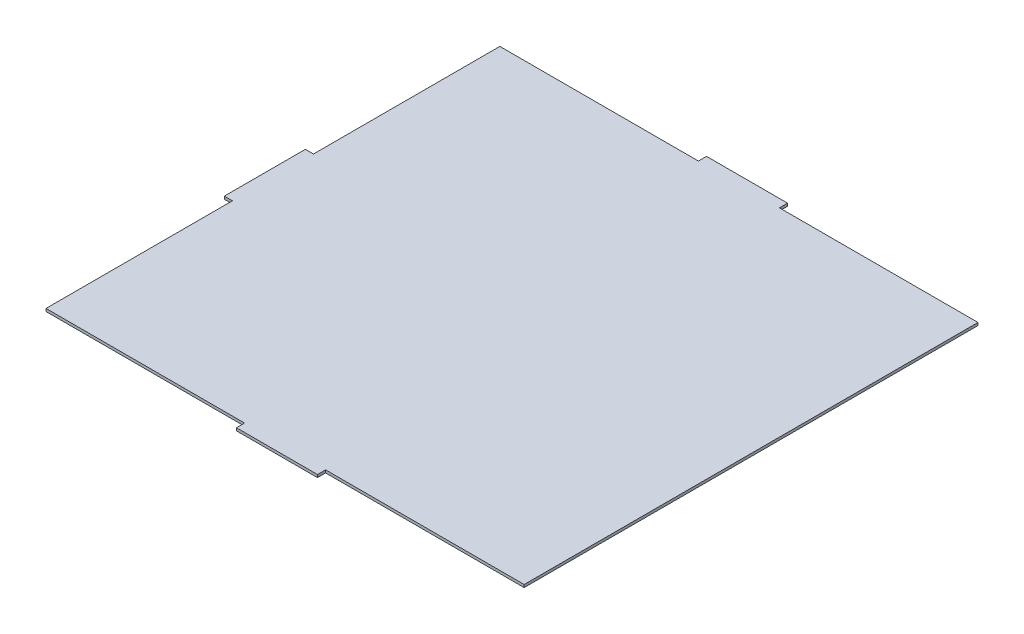
ISO-10303-21;
HEADER;
FILE_DESCRIPTION(('STEP AP214'),'2;1');
FILE_NAME('part.step','',(''),(''),'','','');
FILE_SCHEMA(('AUTOMOTIVE_DESIGN { 1 0 10303 214 1 1 1 1 }'));
ENDSEC;
DATA;
#1=APPLICATION_CONTEXT('core data for automotive mechanical design processes');
#2=APPLICATION_PROTOCOL_DEFINITION('international standard','automotive_design',2000,#1);
#3=PRODUCT_CONTEXT('',#1,'mechanical');
#4=PRODUCT('Part','Part','',(#3));
#5=PRODUCT_RELATED_PRODUCT_CATEGORY('part','',(#4));
#6=PRODUCT_DEFINITION_FORMATION('','',#4);
#7=PRODUCT_DEFINITION_CONTEXT('part definition',#1,'design');
#8=PRODUCT_DEFINITION('design','',#6,#7);
#9=PRODUCT_DEFINITION_SHAPE('','',#8);
#10=(LENGTH_UNIT() NAMED_UNIT(*) SI_UNIT(.MILLI.,.METRE.));
#11=(NAMED_UNIT(*) PLANE_ANGLE_UNIT() SI_UNIT($,.RADIAN.));
#12=(NAMED_UNIT(*) SI_UNIT($,.STERADIAN.) SOLID_ANGLE_UNIT());
#13=UNCERTAINTY_MEASURE_WITH_UNIT(LENGTH_MEASURE(1.E-05),#10,'distance_accuracy_value','');
#14=(GEOMETRIC_REPRESENTATION_CONTEXT(3) GLOBAL_UNCERTAINTY_ASSIGNED_CONTEXT((#13)) GLOBAL_UNIT_ASSIGNED_CONTEXT((#10,
#11,#12)) REPRESENTATION_CONTEXT('',''));
#15=CARTESIAN_POINT('',(0.,0.,0.));
#16=DIRECTION('',(0.,0.,1.));
#17=DIRECTION('',(1.,0.,0.));
#18=AXIS2_PLACEMENT_3D('',#15,#16,#17);
#19=CARTESIAN_POINT('',(-51.6780240662312,1.,-119.991966120482));
#20=DIRECTION('',(1.,0.,0.));
#21=DIRECTION('',(0.,0.,-1.));
#22=AXIS2_PLACEMENT_3D('',#19,#20,#21);
#23=PLANE('',#22);
#24=DIRECTION('',(0.,0.,1.));
#25=VECTOR('',#24,1.);
#26=CARTESIAN_POINT('',(-51.6780240662312,0.,-119.991966120482));
#27=LINE('',#26,#25);
#28=CARTESIAN_POINT('',(-51.6780240662312,0.,-119.991966120482));
#29=VERTEX_POINT('',#28);
#30=CARTESIAN_POINT('',(-51.6780240662312,0.,-50.9919661204817));
#31=VERTEX_POINT('',#30);
#32=EDGE_CURVE('E176',#29,#31,#27,.T.);
#33=ORIENTED_EDGE('',*,*,#32,.T.);
#34=DIRECTION('',(0.,-1.,0.));
#35=VECTOR('',#34,1.);
#36=CARTESIAN_POINT('',(-51.6780240662312,1.,-50.9919661204817));
#37=LINE('',#36,#35);
#38=CARTESIAN_POINT('',(-51.6780240662312,1.,-50.9919661204817));
#39=VERTEX_POINT('',#38);
#40=EDGE_CURVE('E11',#39,#31,#37,.T.);
#41=ORIENTED_EDGE('',*,*,#40,.F.);
#42=DIRECTION('',(0.,0.,1.));
#43=VECTOR('',#42,1.);
#44=CARTESIAN_POINT('',(-51.6780240662312,1.,-119.991966120482));
#45=LINE('',#44,#43);
#46=CARTESIAN_POINT('',(-51.6780240662312,1.,-119.991966120482));
#47=VERTEX_POINT('',#46);
#48=EDGE_CURVE('E206',#47,#39,#45,.T.);
#49=ORIENTED_EDGE('',*,*,#48,.F.);
#50=DIRECTION('',(0.,-1.,0.));
#51=VECTOR('',#50,1.);
#52=CARTESIAN_POINT('',(-51.6780240662312,1.,-119.991966120482));
#53=LINE('',#52,#51);
#54=EDGE_CURVE('E172',#47,#29,#53,.T.);
#55=ORIENTED_EDGE('',*,*,#54,.T.);
#56=EDGE_LOOP('',(#33,#41,#49,#55));
#57=FACE_BOUND('',#56,.T.);
#58=ADVANCED_FACE('F32',(#57),#23,.F.);
#59=CARTESIAN_POINT('',(-51.6780240662312,1.,-50.9919661204817));
#60=DIRECTION('',(0.,0.,1.));
#61=DIRECTION('',(1.,0.,0.));
#62=AXIS2_PLACEMENT_3D('',#59,#60,#61);
#63=PLANE('',#62);
#64=DIRECTION('',(-1.,0.,0.));
#65=VECTOR('',#64,1.);
#66=CARTESIAN_POINT('',(-51.6780240662312,0.,-50.9919661204817));
#67=LINE('',#66,#65);
#68=CARTESIAN_POINT('',(-54.6780240662312,0.,-50.9919661204817));
#69=VERTEX_POINT('',#68);
#70=EDGE_CURVE('E179',#31,#69,#67,.T.);
#71=ORIENTED_EDGE('',*,*,#70,.T.);
#72=DIRECTION('',(0.,-1.,0.));
#73=VECTOR('',#72,1.);
#74=CARTESIAN_POINT('',(-54.6780240662312,1.,-50.9919661204817));
#75=LINE('',#74,#73);
#76=CARTESIAN_POINT('',(-54.6780240662312,1.,-50.9919661204817));
#77=VERTEX_POINT('',#76);
#78=EDGE_CURVE('E40',#77,#69,#75,.T.);
#79=ORIENTED_EDGE('',*,*,#78,.F.);
#80=DIRECTION('',(-1.,0.,0.));
#81=VECTOR('',#80,1.);
#82=CARTESIAN_POINT('',(-51.6780240662312,1.,-50.9919661204817));
#83=LINE('',#82,#81);
#84=EDGE_CURVE('E115',#39,#77,#83,.T.);
#85=ORIENTED_EDGE('',*,*,#84,.F.);
#86=ORIENTED_EDGE('',*,*,#40,.T.);
#87=EDGE_LOOP('',(#71,#79,#85,#86));
#88=FACE_BOUND('',#87,.T.);
#89=ADVANCED_FACE('F304',(#88),#63,.F.);
#90=CARTESIAN_POINT('',(-54.6780240662312,1.,-50.9919661204817));
#91=DIRECTION('',(1.,0.,0.));
#92=DIRECTION('',(0.,0.,-1.));
#93=AXIS2_PLACEMENT_3D('',#90,#91,#92);
#94=PLANE('',#93);
#95=DIRECTION('',(0.,0.,1.));
#96=VECTOR('',#95,1.);
#97=CARTESIAN_POINT('',(-54.6780240662312,0.,-50.9919661204817));
#98=LINE('',#97,#96);
#99=CARTESIAN_POINT('',(-54.6780240662312,0.,-20.9919661204817));
#100=VERTEX_POINT('',#99);
#101=EDGE_CURVE('E181',#69,#100,#98,.T.);
#102=ORIENTED_EDGE('',*,*,#101,.T.);
#103=DIRECTION('',(0.,-1.,0.));
#104=VECTOR('',#103,1.);
#105=CARTESIAN_POINT('',(-54.6780240662312,1.,-20.9919661204817));
#106=LINE('',#105,#104);
#107=CARTESIAN_POINT('',(-54.6780240662312,1.,-20.9919661204817));
#108=VERTEX_POINT('',#107);
#109=EDGE_CURVE('E237',#108,#100,#106,.T.);
#110=ORIENTED_EDGE('',*,*,#109,.F.);
#111=DIRECTION('',(0.,0.,1.));
#112=VECTOR('',#111,1.);
#113=CARTESIAN_POINT('',(-54.6780240662312,1.,-50.9919661204817));
#114=LINE('',#113,#112);
#115=EDGE_CURVE('E245',#77,#108,#114,.T.);
#116=ORIENTED_EDGE('',*,*,#115,.F.);
#117=ORIENTED_EDGE('',*,*,#78,.T.);
#118=EDGE_LOOP('',(#102,#110,#116,#117));
#119=FACE_BOUND('',#118,.T.);
#120=ADVANCED_FACE('F243',(#119),#94,.F.);
#121=CARTESIAN_POINT('',(-54.6780240662312,1.,-20.9919661204817));
#122=DIRECTION('',(0.,0.,-1.));
#123=DIRECTION('',(-1.,0.,0.));
#124=AXIS2_PLACEMENT_3D('',#121,#122,#123);
#125=PLANE('',#124);
#126=DIRECTION('',(1.,0.,0.));
#127=VECTOR('',#126,1.);
#128=CARTESIAN_POINT('',(-54.6780240662312,0.,-20.9919661204817));
#129=LINE('',#128,#127);
#130=CARTESIAN_POINT('',(-51.6780240662312,0.,-20.9919661204817));
#131=VERTEX_POINT('',#130);
#132=EDGE_CURVE('E183',#100,#131,#129,.T.);
#133=ORIENTED_EDGE('',*,*,#132,.T.);
#134=DIRECTION('',(0.,-1.,0.));
#135=VECTOR('',#134,1.);
#136=CARTESIAN_POINT('',(-51.6780240662312,1.,-20.9919661204817));
#137=LINE('',#136,#135);
#138=CARTESIAN_POINT('',(-51.6780240662312,1.,-20.9919661204817));
#139=VERTEX_POINT('',#138);
#140=EDGE_CURVE('E234',#139,#131,#137,.T.);
#141=ORIENTED_EDGE('',*,*,#140,.F.);
#142=DIRECTION('',(1.,0.,0.));
#143=VECTOR('',#142,1.);
#144=CARTESIAN_POINT('',(-54.6780240662312,1.,-20.9919661204817));
#145=LINE('',#144,#143);
#146=EDGE_CURVE('E263',#108,#139,#145,.T.);
#147=ORIENTED_EDGE('',*,*,#146,.F.);
#148=ORIENTED_EDGE('',*,*,#109,.T.);
#149=EDGE_LOOP('',(#133,#141,#147,#148));
#150=FACE_BOUND('',#149,.T.);
#151=ADVANCED_FACE('F254',(#150),#125,.F.);
#152=CARTESIAN_POINT('',(-51.6780240662312,1.,-20.9919661204817));
#153=DIRECTION('',(1.,0.,0.));
#154=DIRECTION('',(0.,0.,-1.));
#155=AXIS2_PLACEMENT_3D('',#152,#153,#154);
#156=PLANE('',#155);
#157=DIRECTION('',(0.,0.,1.));
#158=VECTOR('',#157,1.);
#159=CARTESIAN_POINT('',(-51.6780240662312,0.,-20.9919661204817));
#160=LINE('',#159,#158);
#161=CARTESIAN_POINT('',(-51.6780240662312,0.,48.0080338795183));
#162=VERTEX_POINT('',#161);
#163=EDGE_CURVE('E185',#131,#162,#160,.T.);
#164=ORIENTED_EDGE('',*,*,#163,.T.);
#165=DIRECTION('',(0.,-1.,0.));
#166=VECTOR('',#165,1.);
#167=CARTESIAN_POINT('',(-51.6780240662312,1.,48.0080338795183));
#168=LINE('',#167,#166);
#169=CARTESIAN_POINT('',(-51.6780240662312,1.,48.0080338795183));
#170=VERTEX_POINT('',#169);
#171=EDGE_CURVE('E231',#170,#162,#168,.T.);
#172=ORIENTED_EDGE('',*,*,#171,.F.);
#173=DIRECTION('',(0.,0.,1.));
#174=VECTOR('',#173,1.);
#175=CARTESIAN_POINT('',(-51.6780240662312,1.,-20.9919661204817));
#176=LINE('',#175,#174);
#177=EDGE_CURVE('E260',#139,#170,#176,.T.);
#178=ORIENTED_EDGE('',*,*,#177,.F.);
#179=ORIENTED_EDGE('',*,*,#140,.T.);
#180=EDGE_LOOP('',(#164,#172,#178,#179));
#181=FACE_BOUND('',#180,.T.);
#182=ADVANCED_FACE('F258',(#181),#156,.F.);
#183=CARTESIAN_POINT('',(21.8219759337688,1.,48.0080338795183));
#184=DIRECTION('',(0.,0.,-1.));
#185=DIRECTION('',(-1.,0.,0.));
#186=AXIS2_PLACEMENT_3D('',#183,#184,#185);
#187=PLANE('',#186);
#188=DIRECTION('',(1.,0.,0.));
#189=VECTOR('',#188,1.);
#190=CARTESIAN_POINT('',(21.8219759337688,0.,48.0080338795183));
#191=LINE('',#190,#189);
#192=CARTESIAN_POINT('',(21.8219759337688,0.,48.0080338795183));
#193=VERTEX_POINT('',#192);
#194=EDGE_CURVE('E187',#162,#193,#191,.T.);
#195=ORIENTED_EDGE('',*,*,#194,.T.);
#196=DIRECTION('',(0.,-1.,0.));
#197=VECTOR('',#196,1.);
#198=CARTESIAN_POINT('',(21.8219759337688,1.,48.0080338795183));
#199=LINE('',#198,#197);
#200=CARTESIAN_POINT('',(21.8219759337688,1.,48.0080338795183));
#201=VERTEX_POINT('',#200);
#202=EDGE_CURVE('E228',#201,#193,#199,.T.);
#203=ORIENTED_EDGE('',*,*,#202,.F.);
#204=DIRECTION('',(1.,0.,0.));
#205=VECTOR('',#204,1.);
#206=CARTESIAN_POINT('',(21.8219759337688,1.,48.0080338795183));
#207=LINE('',#206,#205);
#208=EDGE_CURVE('E262',#170,#201,#207,.T.);
#209=ORIENTED_EDGE('',*,*,#208,.F.);
#210=ORIENTED_EDGE('',*,*,#171,.T.);
#211=EDGE_LOOP('',(#195,#203,#209,#210));
#212=FACE_BOUND('',#211,.T.);
#213=ADVANCED_FACE('F317',(#212),#187,.F.);
#214=CARTESIAN_POINT('',(21.8219759337688,1.,51.0080338795183));
#215=DIRECTION('',(1.,0.,0.));
#216=DIRECTION('',(0.,0.,-1.));
#217=AXIS2_PLACEMENT_3D('',#214,#215,#216);
#218=PLANE('',#217);
#219=DIRECTION('',(0.,0.,1.));
#220=VECTOR('',#219,1.);
#221=CARTESIAN_POINT('',(21.8219759337688,0.,51.0080338795183));
#222=LINE('',#221,#220);
#223=CARTESIAN_POINT('',(21.8219759337688,0.,51.0080338795183));
#224=VERTEX_POINT('',#223);
#225=EDGE_CURVE('E189',#193,#224,#222,.T.);
#226=ORIENTED_EDGE('',*,*,#225,.T.);
#227=DIRECTION('',(0.,-1.,0.));
#228=VECTOR('',#227,1.);
#229=CARTESIAN_POINT('',(21.8219759337688,1.,51.0080338795183));
#230=LINE('',#229,#228);
#231=CARTESIAN_POINT('',(21.8219759337688,1.,51.0080338795183));
#232=VERTEX_POINT('',#231);
#233=EDGE_CURVE('E225',#232,#224,#230,.T.);
#234=ORIENTED_EDGE('',*,*,#233,.F.);
#235=DIRECTION('',(0.,0.,1.));
#236=VECTOR('',#235,1.);
#237=CARTESIAN_POINT('',(21.8219759337688,1.,51.0080338795183));
#238=LINE('',#237,#236);
#239=EDGE_CURVE('E265',#201,#232,#238,.T.);
#240=ORIENTED_EDGE('',*,*,#239,.F.);
#241=ORIENTED_EDGE('',*,*,#202,.T.);
#242=EDGE_LOOP('',(#226,#234,#240,#241));
#243=FACE_BOUND('',#242,.T.);
#244=ADVANCED_FACE('F320',(#243),#218,.F.);
#245=CARTESIAN_POINT('',(51.8219759337688,1.,51.0080338795183));
#246=DIRECTION('',(0.,0.,-1.));
#247=DIRECTION('',(-1.,0.,0.));
#248=AXIS2_PLACEMENT_3D('',#245,#246,#247);
#249=PLANE('',#248);
#250=DIRECTION('',(1.,0.,0.));
#251=VECTOR('',#250,1.);
#252=CARTESIAN_POINT('',(51.8219759337688,0.,51.0080338795183));
#253=LINE('',#252,#251);
#254=CARTESIAN_POINT('',(51.8219759337688,0.,51.0080338795183));
#255=VERTEX_POINT('',#254);
#256=EDGE_CURVE('E191',#224,#255,#253,.T.);
#257=ORIENTED_EDGE('',*,*,#256,.T.);
#258=DIRECTION('',(0.,-1.,0.));
#259=VECTOR('',#258,1.);
#260=CARTESIAN_POINT('',(51.8219759337688,1.,51.0080338795183));
#261=LINE('',#260,#259);
#262=CARTESIAN_POINT('',(51.8219759337688,1.,51.0080338795183));
#263=VERTEX_POINT('',#262);
#264=EDGE_CURVE('E222',#263,#255,#261,.T.);
#265=ORIENTED_EDGE('',*,*,#264,.F.);
#266=DIRECTION('',(1.,0.,0.));
#267=VECTOR('',#266,1.);
#268=CARTESIAN_POINT('',(51.8219759337688,1.,51.0080338795183));
#269=LINE('',#268,#267);
#270=EDGE_CURVE('E271',#232,#263,#269,.T.);
#271=ORIENTED_EDGE('',*,*,#270,.F.);
#272=ORIENTED_EDGE('',*,*,#233,.T.);
#273=EDGE_LOOP('',(#257,#265,#271,#272));
#274=FACE_BOUND('',#273,.T.);
#275=ADVANCED_FACE('F324',(#274),#249,.F.);
#276=CARTESIAN_POINT('',(51.8219759337688,1.,48.0080338795183));
#277=DIRECTION('',(-1.,0.,0.));
#278=DIRECTION('',(0.,0.,1.));
#279=AXIS2_PLACEMENT_3D('',#276,#277,#278);
#280=PLANE('',#279);
#281=DIRECTION('',(0.,0.,-1.));
#282=VECTOR('',#281,1.);
#283=CARTESIAN_POINT('',(51.8219759337688,0.,48.0080338795183));
#284=LINE('',#283,#282);
#285=CARTESIAN_POINT('',(51.8219759337688,0.,48.0080338795183));
#286=VERTEX_POINT('',#285);
#287=EDGE_CURVE('E193',#255,#286,#284,.T.);
#288=ORIENTED_EDGE('',*,*,#287,.T.);
#289=DIRECTION('',(0.,-1.,0.));
#290=VECTOR('',#289,1.);
#291=CARTESIAN_POINT('',(51.8219759337688,1.,48.0080338795183));
#292=LINE('',#291,#290);
#293=CARTESIAN_POINT('',(51.8219759337688,1.,48.0080338795183));
#294=VERTEX_POINT('',#293);
#295=EDGE_CURVE('E219',#294,#286,#292,.T.);
#296=ORIENTED_EDGE('',*,*,#295,.F.);
#297=DIRECTION('',(0.,0.,-1.));
#298=VECTOR('',#297,1.);
#299=CARTESIAN_POINT('',(51.8219759337688,1.,48.0080338795183));
#300=LINE('',#299,#298);
#301=EDGE_CURVE('E273',#263,#294,#300,.T.);
#302=ORIENTED_EDGE('',*,*,#301,.F.);
#303=ORIENTED_EDGE('',*,*,#264,.T.);
#304=EDGE_LOOP('',(#288,#296,#302,#303));
#305=FACE_BOUND('',#304,.T.);
#306=ADVANCED_FACE('F328',(#305),#280,.F.);
#307=CARTESIAN_POINT('',(125.321975933769,1.,48.0080338795183));
#308=DIRECTION('',(0.,0.,-1.));
#309=DIRECTION('',(-1.,0.,0.));
#310=AXIS2_PLACEMENT_3D('',#307,#308,#309);
#311=PLANE('',#310);
#312=DIRECTION('',(1.,0.,0.));
#313=VECTOR('',#312,1.);
#314=CARTESIAN_POINT('',(125.321975933769,0.,48.0080338795183));
#315=LINE('',#314,#313);
#316=CARTESIAN_POINT('',(125.321975933769,0.,48.0080338795183));
#317=VERTEX_POINT('',#316);
#318=EDGE_CURVE('E195',#286,#317,#315,.T.);
#319=ORIENTED_EDGE('',*,*,#318,.T.);
#320=DIRECTION('',(0.,-1.,0.));
#321=VECTOR('',#320,1.);
#322=CARTESIAN_POINT('',(125.321975933769,1.,48.0080338795183));
#323=LINE('',#322,#321);
#324=CARTESIAN_POINT('',(125.321975933769,1.,48.0080338795183));
#325=VERTEX_POINT('',#324);
#326=EDGE_CURVE('E216',#325,#317,#323,.T.);
#327=ORIENTED_EDGE('',*,*,#326,.F.);
#328=DIRECTION('',(1.,0.,0.));
#329=VECTOR('',#328,1.);
#330=CARTESIAN_POINT('',(125.321975933769,1.,48.0080338795183));
#331=LINE('',#330,#329);
#332=EDGE_CURVE('E275',#294,#325,#331,.T.);
#333=ORIENTED_EDGE('',*,*,#332,.F.);
#334=ORIENTED_EDGE('',*,*,#295,.T.);
#335=EDGE_LOOP('',(#319,#327,#333,#334));
#336=FACE_BOUND('',#335,.T.);
#337=ADVANCED_FACE('F332',(#336),#311,.F.);
#338=CARTESIAN_POINT('',(125.321975933769,1.,-119.991966120482));
#339=DIRECTION('',(-1.,0.,0.));
#340=DIRECTION('',(0.,0.,1.));
#341=AXIS2_PLACEMENT_3D('',#338,#339,#340);
#342=PLANE('',#341);
#343=DIRECTION('',(0.,0.,-1.));
#344=VECTOR('',#343,1.);
#345=CARTESIAN_POINT('',(125.321975933769,0.,-119.991966120482));
#346=LINE('',#345,#344);
#347=CARTESIAN_POINT('',(125.321975933769,0.,-119.991966120482));
#348=VERTEX_POINT('',#347);
#349=EDGE_CURVE('E197',#317,#348,#346,.T.);
#350=ORIENTED_EDGE('',*,*,#349,.T.);
#351=DIRECTION('',(0.,-1.,0.));
#352=VECTOR('',#351,1.);
#353=CARTESIAN_POINT('',(125.321975933769,1.,-119.991966120482));
#354=LINE('',#353,#352);
#355=CARTESIAN_POINT('',(125.321975933769,1.,-119.991966120482));
#356=VERTEX_POINT('',#355);
#357=EDGE_CURVE('E213',#356,#348,#354,.T.);
#358=ORIENTED_EDGE('',*,*,#357,.F.);
#359=DIRECTION('',(0.,0.,-1.));
#360=VECTOR('',#359,1.);
#361=CARTESIAN_POINT('',(125.321975933769,1.,-119.991966120482));
#362=LINE('',#361,#360);
#363=EDGE_CURVE('E277',#325,#356,#362,.T.);
#364=ORIENTED_EDGE('',*,*,#363,.F.);
#365=ORIENTED_EDGE('',*,*,#326,.T.);
#366=EDGE_LOOP('',(#350,#358,#364,#365));
#367=FACE_BOUND('',#366,.T.);
#368=ADVANCED_FACE('F336',(#367),#342,.F.);
#369=CARTESIAN_POINT('',(51.8219759337688,1.,-119.991966120482));
#370=DIRECTION('',(0.,0.,1.));
#371=DIRECTION('',(1.,0.,0.));
#372=AXIS2_PLACEMENT_3D('',#369,#370,#371);
#373=PLANE('',#372);
#374=DIRECTION('',(-1.,0.,0.));
#375=VECTOR('',#374,1.);
#376=CARTESIAN_POINT('',(51.8219759337688,0.,-119.991966120482));
#377=LINE('',#376,#375);
#378=CARTESIAN_POINT('',(51.8219759337688,0.,-119.991966120482));
#379=VERTEX_POINT('',#378);
#380=EDGE_CURVE('E199',#348,#379,#377,.T.);
#381=ORIENTED_EDGE('',*,*,#380,.T.);
#382=DIRECTION('',(0.,-1.,0.));
#383=VECTOR('',#382,1.);
#384=CARTESIAN_POINT('',(51.8219759337688,1.,-119.991966120482));
#385=LINE('',#384,#383);
#386=CARTESIAN_POINT('',(51.8219759337688,1.,-119.991966120482));
#387=VERTEX_POINT('',#386);
#388=EDGE_CURVE('E210',#387,#379,#385,.T.);
#389=ORIENTED_EDGE('',*,*,#388,.F.);
#390=DIRECTION('',(-1.,0.,0.));
#391=VECTOR('',#390,1.);
#392=CARTESIAN_POINT('',(51.8219759337688,1.,-119.991966120482));
#393=LINE('',#392,#391);
#394=EDGE_CURVE('E279',#356,#387,#393,.T.);
#395=ORIENTED_EDGE('',*,*,#394,.F.);
#396=ORIENTED_EDGE('',*,*,#357,.T.);
#397=EDGE_LOOP('',(#381,#389,#395,#396));
#398=FACE_BOUND('',#397,.T.);
#399=ADVANCED_FACE('F285',(#398),#373,.F.);
#400=CARTESIAN_POINT('',(51.8219759337688,1.,-122.991966120482));
#401=DIRECTION('',(-1.,0.,0.));
#402=DIRECTION('',(0.,0.,1.));
#403=AXIS2_PLACEMENT_3D('',#400,#401,#402);
#404=PLANE('',#403);
#405=DIRECTION('',(0.,0.,-1.));
#406=VECTOR('',#405,1.);
#407=CARTESIAN_POINT('',(51.8219759337688,0.,-122.991966120482));
#408=LINE('',#407,#406);
#409=CARTESIAN_POINT('',(51.8219759337688,0.,-122.991966120482));
#410=VERTEX_POINT('',#409);
#411=EDGE_CURVE('E201',#379,#410,#408,.T.);
#412=ORIENTED_EDGE('',*,*,#411,.T.);
#413=DIRECTION('',(0.,-1.,0.));
#414=VECTOR('',#413,1.);
#415=CARTESIAN_POINT('',(51.8219759337688,1.,-122.991966120482));
#416=LINE('',#415,#414);
#417=CARTESIAN_POINT('',(51.8219759337688,1.,-122.991966120482));
#418=VERTEX_POINT('',#417);
#419=EDGE_CURVE('E167',#418,#410,#416,.T.);
#420=ORIENTED_EDGE('',*,*,#419,.F.);
#421=DIRECTION('',(0.,0.,-1.));
#422=VECTOR('',#421,1.);
#423=CARTESIAN_POINT('',(51.8219759337688,1.,-122.991966120482));
#424=LINE('',#423,#422);
#425=EDGE_CURVE('E158',#387,#418,#424,.T.);
#426=ORIENTED_EDGE('',*,*,#425,.F.);
#427=ORIENTED_EDGE('',*,*,#388,.T.);
#428=EDGE_LOOP('',(#412,#420,#426,#427));
#429=FACE_BOUND('',#428,.T.);
#430=ADVANCED_FACE('F289',(#429),#404,.F.);
#431=CARTESIAN_POINT('',(21.8219759337688,1.,-122.991966120482));
#432=DIRECTION('',(0.,0.,1.));
#433=DIRECTION('',(1.,0.,0.));
#434=AXIS2_PLACEMENT_3D('',#431,#432,#433);
#435=PLANE('',#434);
#436=DIRECTION('',(-1.,0.,0.));
#437=VECTOR('',#436,1.);
#438=CARTESIAN_POINT('',(21.8219759337688,0.,-122.991966120482));
#439=LINE('',#438,#437);
#440=CARTESIAN_POINT('',(21.8219759337688,0.,-122.991966120482));
#441=VERTEX_POINT('',#440);
#442=EDGE_CURVE('E166',#410,#441,#439,.T.);
#443=ORIENTED_EDGE('',*,*,#442,.T.);
#444=DIRECTION('',(0.,-1.,0.));
#445=VECTOR('',#444,1.);
#446=CARTESIAN_POINT('',(21.8219759337688,1.,-122.991966120482));
#447=LINE('',#446,#445);
#448=CARTESIAN_POINT('',(21.8219759337688,1.,-122.991966120482));
#449=VERTEX_POINT('',#448);
#450=EDGE_CURVE('E163',#449,#441,#447,.T.);
#451=ORIENTED_EDGE('',*,*,#450,.F.);
#452=DIRECTION('',(-1.,0.,0.));
#453=VECTOR('',#452,1.);
#454=CARTESIAN_POINT('',(21.8219759337688,1.,-122.991966120482));
#455=LINE('',#454,#453);
#456=EDGE_CURVE('E152',#418,#449,#455,.T.);
#457=ORIENTED_EDGE('',*,*,#456,.F.);
#458=ORIENTED_EDGE('',*,*,#419,.T.);
#459=EDGE_LOOP('',(#443,#451,#457,#458));
#460=FACE_BOUND('',#459,.T.);
#461=ADVANCED_FACE('F164',(#460),#435,.F.);
#462=CARTESIAN_POINT('',(21.8219759337688,1.,-119.991966120482));
#463=DIRECTION('',(1.,0.,0.));
#464=DIRECTION('',(0.,0.,-1.));
#465=AXIS2_PLACEMENT_3D('',#462,#463,#464);
#466=PLANE('',#465);
#467=DIRECTION('',(0.,0.,1.));
#468=VECTOR('',#467,1.);
#469=CARTESIAN_POINT('',(21.8219759337688,0.,-119.991966120482));
#470=LINE('',#469,#468);
#471=CARTESIAN_POINT('',(21.8219759337688,0.,-119.991966120482));
#472=VERTEX_POINT('',#471);
#473=EDGE_CURVE('E101',#441,#472,#470,.T.);
#474=ORIENTED_EDGE('',*,*,#473,.T.);
#475=DIRECTION('',(0.,-1.,0.));
#476=VECTOR('',#475,1.);
#477=CARTESIAN_POINT('',(21.8219759337688,1.,-119.991966120482));
#478=LINE('',#477,#476);
#479=CARTESIAN_POINT('',(21.8219759337688,1.,-119.991966120482));
#480=VERTEX_POINT('',#479);
#481=EDGE_CURVE('E168',#480,#472,#478,.T.);
#482=ORIENTED_EDGE('',*,*,#481,.F.);
#483=DIRECTION('',(0.,0.,1.));
#484=VECTOR('',#483,1.);
#485=CARTESIAN_POINT('',(21.8219759337688,1.,-119.991966120482));
#486=LINE('',#485,#484);
#487=EDGE_CURVE('E156',#449,#480,#486,.T.);
#488=ORIENTED_EDGE('',*,*,#487,.F.);
#489=ORIENTED_EDGE('',*,*,#450,.T.);
#490=EDGE_LOOP('',(#474,#482,#488,#489));
#491=FACE_BOUND('',#490,.T.);
#492=ADVANCED_FACE('F170',(#491),#466,.F.);
#493=CARTESIAN_POINT('',(-51.6780240662312,1.,-119.991966120482));
#494=DIRECTION('',(0.,0.,1.));
#495=DIRECTION('',(1.,0.,0.));
#496=AXIS2_PLACEMENT_3D('',#493,#494,#495);
#497=PLANE('',#496);
#498=DIRECTION('',(-1.,0.,0.));
#499=VECTOR('',#498,1.);
#500=CARTESIAN_POINT('',(-51.6780240662312,0.,-119.991966120482));
#501=LINE('',#500,#499);
#502=EDGE_CURVE('E107',#472,#29,#501,.T.);
#503=ORIENTED_EDGE('',*,*,#502,.T.);
#504=ORIENTED_EDGE('',*,*,#54,.F.);
#505=DIRECTION('',(-1.,0.,0.));
#506=VECTOR('',#505,1.);
#507=CARTESIAN_POINT('',(-51.6780240662312,1.,-119.991966120482));
#508=LINE('',#507,#506);
#509=EDGE_CURVE('E48',#480,#47,#508,.T.);
#510=ORIENTED_EDGE('',*,*,#509,.F.);
#511=ORIENTED_EDGE('',*,*,#481,.T.);
#512=EDGE_LOOP('',(#503,#504,#510,#511));
#513=FACE_BOUND('',#512,.T.);
#514=ADVANCED_FACE('F293',(#513),#497,.F.);
#515=CARTESIAN_POINT('',(0.,1.,0.));
#516=DIRECTION('',(0.,-1.,0.));
#517=DIRECTION('',(0.,0.,-1.));
#518=AXIS2_PLACEMENT_3D('',#515,#516,#517);
#519=PLANE('',#518);
#520=ORIENTED_EDGE('',*,*,#48,.T.);
#521=ORIENTED_EDGE('',*,*,#84,.T.);
#522=ORIENTED_EDGE('',*,*,#115,.T.);
#523=ORIENTED_EDGE('',*,*,#146,.T.);
#524=ORIENTED_EDGE('',*,*,#177,.T.);
#525=ORIENTED_EDGE('',*,*,#208,.T.);
#526=ORIENTED_EDGE('',*,*,#239,.T.);
#527=ORIENTED_EDGE('',*,*,#270,.T.);
#528=ORIENTED_EDGE('',*,*,#301,.T.);
#529=ORIENTED_EDGE('',*,*,#332,.T.);
#530=ORIENTED_EDGE('',*,*,#363,.T.);
#531=ORIENTED_EDGE('',*,*,#394,.T.);
#532=ORIENTED_EDGE('',*,*,#425,.T.);
#533=ORIENTED_EDGE('',*,*,#456,.T.);
#534=ORIENTED_EDGE('',*,*,#487,.T.);
#535=ORIENTED_EDGE('',*,*,#509,.T.);
#536=EDGE_LOOP('',(#520,#521,#522,#523,#524,#525,#526,#527,#528,#529,#530,#531,#532,#533,#534,#535));
#537=FACE_BOUND('',#536,.T.);
#538=ADVANCED_FACE('F154',(#537),#519,.F.);
#539=CARTESIAN_POINT('',(0.,0.,0.));
#540=DIRECTION('',(0.,-1.,0.));
#541=DIRECTION('',(0.,0.,-1.));
#542=AXIS2_PLACEMENT_3D('',#539,#540,#541);
#543=PLANE('',#542);
#544=ORIENTED_EDGE('',*,*,#32,.F.);
#545=ORIENTED_EDGE('',*,*,#502,.F.);
#546=ORIENTED_EDGE('',*,*,#473,.F.);
#547=ORIENTED_EDGE('',*,*,#442,.F.);
#548=ORIENTED_EDGE('',*,*,#411,.F.);
#549=ORIENTED_EDGE('',*,*,#380,.F.);
#550=ORIENTED_EDGE('',*,*,#349,.F.);
#551=ORIENTED_EDGE('',*,*,#318,.F.);
#552=ORIENTED_EDGE('',*,*,#287,.F.);
#553=ORIENTED_EDGE('',*,*,#256,.F.);
#554=ORIENTED_EDGE('',*,*,#225,.F.);
#555=ORIENTED_EDGE('',*,*,#194,.F.);
#556=ORIENTED_EDGE('',*,*,#163,.F.);
#557=ORIENTED_EDGE('',*,*,#132,.F.);
#558=ORIENTED_EDGE('',*,*,#101,.F.);
#559=ORIENTED_EDGE('',*,*,#70,.F.);
#560=EDGE_LOOP('',(#544,#545,#546,#547,#548,#549,#550,#551,#552,#553,#554,#555,#556,#557,#558,#559));
#561=FACE_BOUND('',#560,.T.);
#562=ADVANCED_FACE('F249',(#561),#543,.T.);
#563=CLOSED_SHELL('',(#58,#89,#120,#151,#182,#213,#244,#275,#306,#337,#368,#399,#430,#461,#492,
#514,#538,#562));
#564=MANIFOLD_SOLID_BREP('B2',#563);
#565=ADVANCED_BREP_SHAPE_REPRESENTATION('',(#18,#564),#14);
#566=SHAPE_DEFINITION_REPRESENTATION(#9,#565);
ENDSEC;
END-ISO-10303-21;
